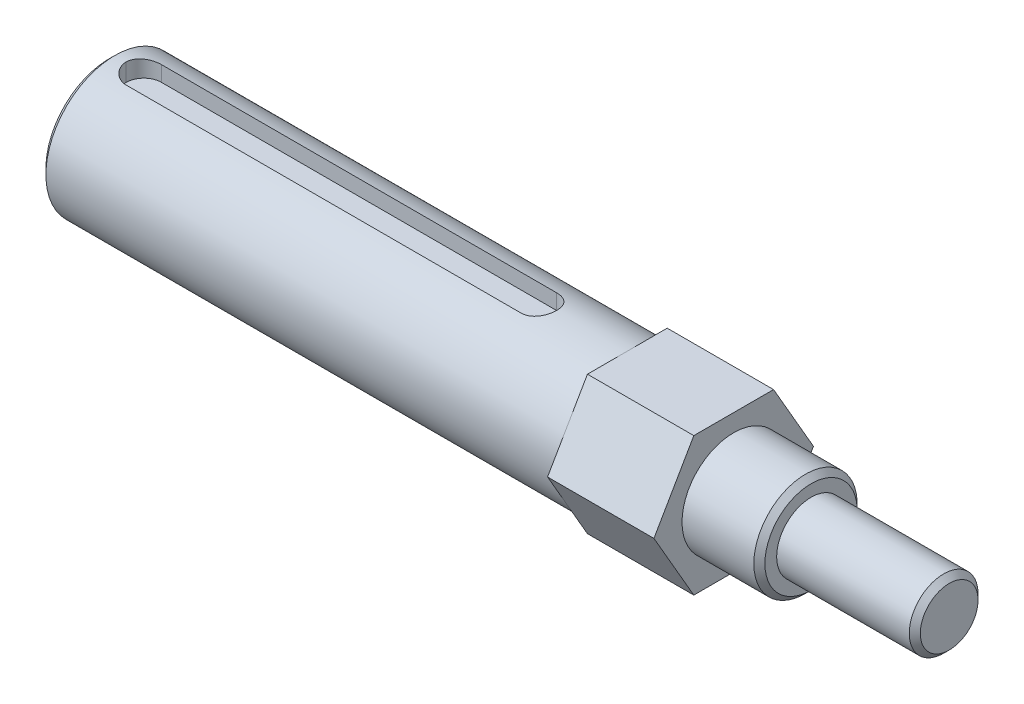
ISO-10303-21;
HEADER;
FILE_DESCRIPTION(('STEP AP214'),'2;1');
FILE_NAME('part.step','',(''),(''),'','','');
FILE_SCHEMA(('AUTOMOTIVE_DESIGN { 1 0 10303 214 1 1 1 1 }'));
ENDSEC;
DATA;
#1=APPLICATION_CONTEXT('core data for automotive mechanical design processes');
#2=APPLICATION_PROTOCOL_DEFINITION('international standard','automotive_design',2000,#1);
#3=PRODUCT_CONTEXT('',#1,'mechanical');
#4=PRODUCT('Part','Part','',(#3));
#5=PRODUCT_RELATED_PRODUCT_CATEGORY('part','',(#4));
#6=PRODUCT_DEFINITION_FORMATION('','',#4);
#7=PRODUCT_DEFINITION_CONTEXT('part definition',#1,'design');
#8=PRODUCT_DEFINITION('design','',#6,#7);
#9=PRODUCT_DEFINITION_SHAPE('','',#8);
#10=(LENGTH_UNIT() NAMED_UNIT(*) SI_UNIT(.MILLI.,.METRE.));
#11=(NAMED_UNIT(*) PLANE_ANGLE_UNIT() SI_UNIT($,.RADIAN.));
#12=(NAMED_UNIT(*) SI_UNIT($,.STERADIAN.) SOLID_ANGLE_UNIT());
#13=UNCERTAINTY_MEASURE_WITH_UNIT(LENGTH_MEASURE(1.E-05),#10,'distance_accuracy_value','');
#14=(GEOMETRIC_REPRESENTATION_CONTEXT(3) GLOBAL_UNCERTAINTY_ASSIGNED_CONTEXT((#13)) GLOBAL_UNIT_ASSIGNED_CONTEXT((#10,
#11,#12)) REPRESENTATION_CONTEXT('',''));
#15=CARTESIAN_POINT('',(0.,0.,0.));
#16=DIRECTION('',(0.,0.,1.));
#17=DIRECTION('',(1.,0.,0.));
#18=AXIS2_PLACEMENT_3D('',#15,#16,#17);
#19=CARTESIAN_POINT('',(-77.8966516553296,0.,0.));
#20=DIRECTION('',(-1.,0.,0.));
#21=DIRECTION('',(0.,0.,1.));
#22=AXIS2_PLACEMENT_3D('',#19,#20,#21);
#23=CYLINDRICAL_SURFACE('',#22,6.3373);
#24=CARTESIAN_POINT('',(-60.299507544,0.,0.));
#25=DIRECTION('',(1.,0.,0.));
#26=DIRECTION('',(0.,0.,-1.));
#27=AXIS2_PLACEMENT_3D('',#24,#25,#26);
#28=CIRCLE('',#27,6.3373);
#29=CARTESIAN_POINT('',(-60.299507544,0.,-6.3373));
#30=VERTEX_POINT('',#29);
#31=EDGE_CURVE('E12',#30,#30,#28,.T.);
#32=ORIENTED_EDGE('',*,*,#31,.T.);
#33=EDGE_LOOP('',(#32));
#34=FACE_BOUND('',#33,.T.);
#35=CARTESIAN_POINT('',(-13.1826,0.,0.));
#36=DIRECTION('',(1.,0.,0.));
#37=DIRECTION('',(0.,0.,-1.));
#38=AXIS2_PLACEMENT_3D('',#35,#36,#37);
#39=CIRCLE('',#38,6.3373);
#40=CARTESIAN_POINT('',(-13.1826,0.,-6.3373));
#41=VERTEX_POINT('',#40);
#42=EDGE_CURVE('E203',#41,#41,#39,.T.);
#43=ORIENTED_EDGE('',*,*,#42,.F.);
#44=EDGE_LOOP('',(#43));
#45=FACE_BOUND('',#44,.T.);
#46=DIRECTION('',(-1.,0.,0.));
#47=VECTOR('',#46,1.);
#48=CARTESIAN_POINT('',(-19.685,6.12525884595908,-1.6256));
#49=LINE('',#48,#47);
#50=CARTESIAN_POINT('',(-21.3106,6.12525884595908,-1.6256));
#51=VERTEX_POINT('',#50);
#52=CARTESIAN_POINT('',(-57.6326,6.12525884595908,-1.6256));
#53=VERTEX_POINT('',#52);
#54=EDGE_CURVE('E160',#51,#53,#49,.T.);
#55=ORIENTED_EDGE('',*,*,#54,.F.);
#56=CARTESIAN_POINT('',(-21.3106,6.12525884595908,-1.6256));
#57=CARTESIAN_POINT('',(-21.2656704057156,6.12525572384563,-1.62560059359541));
#58=CARTESIAN_POINT('',(-21.2207631160373,6.12575382111828,-1.62373611327884));
#59=CARTESIAN_POINT('',(-21.1312852297546,6.12772023070614,-1.61630382884971));
#60=CARTESIAN_POINT('',(-21.0867145755947,6.1291883731897,-1.61073667298571));
#61=CARTESIAN_POINT('',(-20.9541866425597,6.13498823313774,-1.58856472188929));
#62=CARTESIAN_POINT('',(-20.867141318364,6.1407157654718,-1.56648906409845));
#63=CARTESIAN_POINT('',(-20.6981498950922,6.15522368993519,-1.50846753261054));
#64=CARTESIAN_POINT('',(-20.6162032514929,6.16400375540148,-1.4725231430134));
#65=CARTESIAN_POINT('',(-20.4594573465982,6.18362256546917,-1.38782812844854));
#66=CARTESIAN_POINT('',(-20.3846603993658,6.19446197322662,-1.33907337630429));
#67=CARTESIAN_POINT('',(-20.2426607202283,6.2172556448923,-1.22895152920036));
#68=CARTESIAN_POINT('',(-20.1756473789229,6.22922835050251,-1.16734411036551));
#69=CARTESIAN_POINT('',(-20.0527746810287,6.25278150355666,-1.03377269014187));
#70=CARTESIAN_POINT('',(-19.996917445204,6.26436187607171,-0.961806724069569));
#71=CARTESIAN_POINT('',(-19.897152763142,6.28603333152416,-0.808240287847817));
#72=CARTESIAN_POINT('',(-19.8534373219082,6.2960994438836,-0.72651138810322));
#73=CARTESIAN_POINT('',(-19.7804621122823,6.3133870022584,-0.556585175203296));
#74=CARTESIAN_POINT('',(-19.7511910142288,6.3206106768832,-0.468392994195326));
#75=CARTESIAN_POINT('',(-19.7148282586417,6.32969793982603,-0.316446996824047));
#76=CARTESIAN_POINT('',(-19.703660534494,6.33253187833251,-0.253696589976846));
#77=CARTESIAN_POINT('',(-19.688741482479,6.33634021383192,-0.127308675421664));
#78=CARTESIAN_POINT('',(-19.6849851812931,6.33731585778887,-0.0636717914664028));
#79=CARTESIAN_POINT('',(-19.685,6.3373,0.));
#80=B_SPLINE_CURVE_WITH_KNOTS('',3,(#56,#57,#58,#59,#60,#61,#62,#63,#64,#65,#66,#67,#68,#69,#70,
#71,#72,#73,#74,#75,#76,#77,#78,#79),.UNSPECIFIED.,.F.,.F.,(4,2,2,2,2,2,2,2,2,2,2,4),(0.,
0.134703499533245,0.269383421961178,0.537937715227137,0.806463278330569,1.07507545991937,
1.34925144595122,1.62347950304872,1.90182481040237,2.17995144456139,2.37091142600285,
2.56174322311852),.UNSPECIFIED.);
#81=CARTESIAN_POINT('',(-19.685,6.3373,0.));
#82=VERTEX_POINT('',#81);
#83=EDGE_CURVE('E57',#51,#82,#80,.T.);
#84=ORIENTED_EDGE('',*,*,#83,.T.);
#85=CARTESIAN_POINT('',(-19.685,6.3373,0.));
#86=CARTESIAN_POINT('',(-19.6849994724776,6.33730262510674,0.0449542425937188));
#87=CARTESIAN_POINT('',(-19.6868659368972,6.3368210850164,0.0898862632128934));
#88=CARTESIAN_POINT('',(-19.6943065539844,6.33491762685194,0.179415017360768));
#89=CARTESIAN_POINT('',(-19.6998801100268,6.33349586009957,0.224011803674766));
#90=CARTESIAN_POINT('',(-19.722079783265,6.32787281500522,0.356627420790512));
#91=CARTESIAN_POINT('',(-19.744185266898,6.32231346764921,0.443736130091751));
#92=CARTESIAN_POINT('',(-19.8022935544823,6.30816926443299,0.612857979566186));
#93=CARTESIAN_POINT('',(-19.8382957426156,6.29958454264057,0.694871345347297));
#94=CARTESIAN_POINT('',(-19.923125953312,6.28030081893936,0.851727985893962));
#95=CARTESIAN_POINT('',(-19.9719575827631,6.2696012226615,0.926569236192276));
#96=CARTESIAN_POINT('',(-20.0821587854166,6.24699181616045,1.06852125543959));
#97=CARTESIAN_POINT('',(-20.1437513207542,6.23506269652202,1.13545577598838));
#98=CARTESIAN_POINT('',(-20.2772601848964,6.21146345120383,1.25817578073134));
#99=CARTESIAN_POINT('',(-20.3491788334945,6.19979338440312,1.31395875294065));
#100=CARTESIAN_POINT('',(-20.5026996009408,6.17783487513916,1.41364180067815));
#101=CARTESIAN_POINT('',(-20.5844383675886,6.1675715555603,1.45733724079769));
#102=CARTESIAN_POINT('',(-20.7543836681778,6.14988260208591,1.53027187336696));
#103=CARTESIAN_POINT('',(-20.8425848081236,6.14245463303677,1.55952296782704));
#104=CARTESIAN_POINT('',(-20.9944765842876,6.13310075202288,1.59583291165458));
#105=CARTESIAN_POINT('',(-21.0571592670381,6.13017934666502,1.6069770692438));
#106=CARTESIAN_POINT('',(-21.1834164651046,6.12624993016256,1.62186584965615));
#107=CARTESIAN_POINT('',(-21.2469904164994,6.12524075968339,1.62561495594876));
#108=CARTESIAN_POINT('',(-21.3106,6.12525884595908,1.6256));
#109=B_SPLINE_CURVE_WITH_KNOTS('',3,(#85,#86,#87,#88,#89,#90,#91,#92,#93,#94,#95,#96,#97,#98,
#99,#100,#101,#102,#103,#104,#105,#106,#107,#108),.UNSPECIFIED.,.F.,.F.,(4,2,2,2,2,2,2,2,2,2,2,
4),(0.,0.134777673646629,0.269533661211901,0.538262128855104,0.806978689442318,1.07577087838815,
1.34972979958482,1.62375036308561,1.90215983877244,2.18033952316408,2.37109902366022,
2.56174283495162),.UNSPECIFIED.);
#110=CARTESIAN_POINT('',(-21.3106,6.12525884595908,1.6256));
#111=VERTEX_POINT('',#110);
#112=EDGE_CURVE('E224',#82,#111,#109,.T.);
#113=ORIENTED_EDGE('',*,*,#112,.T.);
#114=DIRECTION('',(-1.,0.,0.));
#115=VECTOR('',#114,1.);
#116=CARTESIAN_POINT('',(-19.685,6.12525884595908,1.6256));
#117=LINE('',#116,#115);
#118=CARTESIAN_POINT('',(-57.6326,6.12525884595908,1.6256));
#119=VERTEX_POINT('',#118);
#120=EDGE_CURVE('E173',#111,#119,#117,.T.);
#121=ORIENTED_EDGE('',*,*,#120,.T.);
#122=CARTESIAN_POINT('',(-57.6326,6.12525884595908,1.6256));
#123=CARTESIAN_POINT('',(-57.6775295942844,6.12525572384562,1.62560059359541));
#124=CARTESIAN_POINT('',(-57.7224368839627,6.12575382111828,1.62373611327884));
#125=CARTESIAN_POINT('',(-57.8119147702454,6.12772023070614,1.61630382884971));
#126=CARTESIAN_POINT('',(-57.8564854244053,6.1291883731897,1.61073667298571));
#127=CARTESIAN_POINT('',(-57.9890133574403,6.13498823313774,1.58856472188929));
#128=CARTESIAN_POINT('',(-58.076058681636,6.1407157654718,1.56648906409845));
#129=CARTESIAN_POINT('',(-58.2450501049078,6.15522368993518,1.50846753261054));
#130=CARTESIAN_POINT('',(-58.3269967485071,6.16400375540147,1.4725231430134));
#131=CARTESIAN_POINT('',(-58.4837426534018,6.18362256546917,1.38782812844854));
#132=CARTESIAN_POINT('',(-58.5585396006342,6.19446197322662,1.33907337630429));
#133=CARTESIAN_POINT('',(-58.7005392797717,6.2172556448923,1.22895152920036));
#134=CARTESIAN_POINT('',(-58.7675526210771,6.22922835050251,1.16734411036551));
#135=CARTESIAN_POINT('',(-58.8904253189713,6.25278150355666,1.03377269014188));
#136=CARTESIAN_POINT('',(-58.946282554796,6.2643618760717,0.961806724069576));
#137=CARTESIAN_POINT('',(-59.046047236858,6.28603333152416,0.808240287847822));
#138=CARTESIAN_POINT('',(-59.0897626780918,6.2960994438836,0.726511388103223));
#139=CARTESIAN_POINT('',(-59.1627378877177,6.3133870022584,0.5565851752033));
#140=CARTESIAN_POINT('',(-59.1920089857712,6.3206106768832,0.468392994195332));
#141=CARTESIAN_POINT('',(-59.2283717413583,6.32969793982603,0.316446996824053));
#142=CARTESIAN_POINT('',(-59.239539465506,6.33253187833251,0.25369658997685));
#143=CARTESIAN_POINT('',(-59.254458517521,6.33634021383191,0.127308675421667));
#144=CARTESIAN_POINT('',(-59.2582148187069,6.33731585778887,0.063671791466404));
#145=CARTESIAN_POINT('',(-59.2582,6.3373,0.));
#146=B_SPLINE_CURVE_WITH_KNOTS('',3,(#122,#123,#124,#125,#126,#127,#128,#129,#130,#131,#132,
#133,#134,#135,#136,#137,#138,#139,#140,#141,#142,#143,#144,#145),.UNSPECIFIED.,.F.,.F.,(4,2,2,
2,2,2,2,2,2,2,2,4),(0.,0.134703499533245,0.269383421961175,0.537937715227133,0.806463278330568,
1.07507545991937,1.34925144595121,1.62347950304871,1.90182481040237,2.17995144456138,
2.37091142600284,2.56174322311852),.UNSPECIFIED.);
#147=CARTESIAN_POINT('',(-59.2582,6.3373,0.));
#148=VERTEX_POINT('',#147);
#149=EDGE_CURVE('E50',#119,#148,#146,.T.);
#150=ORIENTED_EDGE('',*,*,#149,.T.);
#151=CARTESIAN_POINT('',(-59.2582,6.3373,0.));
#152=CARTESIAN_POINT('',(-59.2582005275224,6.33730262510674,-0.0449542425937189));
#153=CARTESIAN_POINT('',(-59.2563340631028,6.3368210850164,-0.0898862632128936));
#154=CARTESIAN_POINT('',(-59.2488934460156,6.33491762685194,-0.179415017360768));
#155=CARTESIAN_POINT('',(-59.2433198899732,6.33349586009958,-0.224011803674766));
#156=CARTESIAN_POINT('',(-59.221120216735,6.32787281500522,-0.356627420790512));
#157=CARTESIAN_POINT('',(-59.199014733102,6.32231346764921,-0.443736130091751));
#158=CARTESIAN_POINT('',(-59.1409064455177,6.30816926443299,-0.612857979566185));
#159=CARTESIAN_POINT('',(-59.1049042573844,6.29958454264057,-0.694871345347295));
#160=CARTESIAN_POINT('',(-59.020074046688,6.28030081893936,-0.85172798589396));
#161=CARTESIAN_POINT('',(-58.9712424172369,6.2696012226615,-0.926569236192274));
#162=CARTESIAN_POINT('',(-58.8610412145834,6.24699181616045,-1.06852125543958));
#163=CARTESIAN_POINT('',(-58.7994486792458,6.23506269652202,-1.13545577598838));
#164=CARTESIAN_POINT('',(-58.6659398151036,6.21146345120383,-1.25817578073134));
#165=CARTESIAN_POINT('',(-58.5940211665055,6.19979338440312,-1.31395875294064));
#166=CARTESIAN_POINT('',(-58.4405003990592,6.17783487513916,-1.41364180067815));
#167=CARTESIAN_POINT('',(-58.3587616324114,6.1675715555603,-1.45733724079769));
#168=CARTESIAN_POINT('',(-58.1888163318222,6.14988260208591,-1.53027187336696));
#169=CARTESIAN_POINT('',(-58.1006151918764,6.14245463303677,-1.55952296782704));
#170=CARTESIAN_POINT('',(-57.9487234157124,6.13310075202288,-1.59583291165458));
#171=CARTESIAN_POINT('',(-57.8860407329619,6.13017934666502,-1.6069770692438));
#172=CARTESIAN_POINT('',(-57.7597835348954,6.12624993016256,-1.62186584965615));
#173=CARTESIAN_POINT('',(-57.6962095835006,6.12524075968339,-1.62561495594876));
#174=CARTESIAN_POINT('',(-57.6326,6.12525884595908,-1.6256));
#175=B_SPLINE_CURVE_WITH_KNOTS('',3,(#151,#152,#153,#154,#155,#156,#157,#158,#159,#160,#161,
#162,#163,#164,#165,#166,#167,#168,#169,#170,#171,#172,#173,#174),.UNSPECIFIED.,.F.,.F.,(4,2,2,
2,2,2,2,2,2,2,2,4),(0.,0.134777673646629,0.2695336612119,0.538262128855103,0.806978689442315,
1.07577087838815,1.34972979958481,1.6237503630856,1.90215983877244,2.18033952316408,
2.37109902366021,2.56174283495161),.UNSPECIFIED.);
#176=EDGE_CURVE('E261',#148,#53,#175,.T.);
#177=ORIENTED_EDGE('',*,*,#176,.T.);
#178=EDGE_LOOP('',(#55,#84,#113,#121,#150,#177));
#179=FACE_BOUND('',#178,.T.);
#180=ADVANCED_FACE('F35',(#34,#45,#179),#23,.T.);
#181=CARTESIAN_POINT('',(16.4084,3.16215,0.));
#182=DIRECTION('',(-1.,0.,0.));
#183=DIRECTION('',(0.,0.,1.));
#184=AXIS2_PLACEMENT_3D('',#181,#182,#183);
#185=PLANE('',#184);
#186=CARTESIAN_POINT('',(16.4084,0.,0.));
#187=DIRECTION('',(-1.,0.,0.));
#188=DIRECTION('',(0.,0.,1.));
#189=AXIS2_PLACEMENT_3D('',#186,#187,#188);
#190=CIRCLE('',#189,2.65405754399999);
#191=CARTESIAN_POINT('',(16.4084,0.,2.65405754399999));
#192=VERTEX_POINT('',#191);
#193=EDGE_CURVE('E275',#192,#192,#190,.F.);
#194=ORIENTED_EDGE('',*,*,#193,.T.);
#195=EDGE_LOOP('',(#194));
#196=FACE_BOUND('',#195,.T.);
#197=ADVANCED_FACE('F298',(#196),#185,.F.);
#198=CARTESIAN_POINT('',(-77.8966516553296,0.,0.));
#199=DIRECTION('',(-1.,0.,0.));
#200=DIRECTION('',(0.,0.,1.));
#201=AXIS2_PLACEMENT_3D('',#198,#199,#200);
#202=CYLINDRICAL_SURFACE('',#201,3.16215);
#203=CARTESIAN_POINT('',(15.900307544,0.,0.));
#204=DIRECTION('',(-1.,0.,0.));
#205=DIRECTION('',(0.,0.,1.));
#206=AXIS2_PLACEMENT_3D('',#203,#204,#205);
#207=CIRCLE('',#206,3.16215);
#208=CARTESIAN_POINT('',(15.900307544,0.,3.16215));
#209=VERTEX_POINT('',#208);
#210=EDGE_CURVE('E266',#209,#209,#207,.T.);
#211=ORIENTED_EDGE('',*,*,#210,.T.);
#212=EDGE_LOOP('',(#211));
#213=FACE_BOUND('',#212,.T.);
#214=CARTESIAN_POINT('',(3.7084,0.,0.));
#215=DIRECTION('',(-1.,0.,0.));
#216=DIRECTION('',(0.,0.,1.));
#217=AXIS2_PLACEMENT_3D('',#214,#215,#216);
#218=CIRCLE('',#217,3.16215);
#219=CARTESIAN_POINT('',(3.7084,0.,3.16215));
#220=VERTEX_POINT('',#219);
#221=EDGE_CURVE('E194',#220,#220,#218,.T.);
#222=ORIENTED_EDGE('',*,*,#221,.F.);
#223=EDGE_LOOP('',(#222));
#224=FACE_BOUND('',#223,.T.);
#225=ADVANCED_FACE('F303',(#213,#224),#202,.T.);
#226=CARTESIAN_POINT('',(3.70839999999999,4.7498,0.));
#227=DIRECTION('',(-1.,0.,0.));
#228=DIRECTION('',(0.,0.,1.));
#229=AXIS2_PLACEMENT_3D('',#226,#227,#228);
#230=PLANE('',#229);
#231=CARTESIAN_POINT('',(3.70839999999999,0.,0.));
#232=DIRECTION('',(-1.,0.,0.));
#233=DIRECTION('',(0.,0.,1.));
#234=AXIS2_PLACEMENT_3D('',#231,#232,#233);
#235=CIRCLE('',#234,4.24170754400003);
#236=CARTESIAN_POINT('',(3.70839999999999,0.,4.24170754400003));
#237=VERTEX_POINT('',#236);
#238=EDGE_CURVE('E281',#237,#237,#235,.F.);
#239=ORIENTED_EDGE('',*,*,#238,.T.);
#240=EDGE_LOOP('',(#239));
#241=FACE_BOUND('',#240,.T.);
#242=ORIENTED_EDGE('',*,*,#221,.T.);
#243=EDGE_LOOP('',(#242));
#244=FACE_BOUND('',#243,.T.);
#245=ADVANCED_FACE('F371',(#241,#244),#230,.F.);
#246=CARTESIAN_POINT('',(-77.8966516553296,0.,0.));
#247=DIRECTION('',(-1.,0.,0.));
#248=DIRECTION('',(0.,0.,1.));
#249=AXIS2_PLACEMENT_3D('',#246,#247,#248);
#250=CYLINDRICAL_SURFACE('',#249,4.7498);
#251=CARTESIAN_POINT('',(3.20030754400003,0.,0.));
#252=DIRECTION('',(-1.,0.,0.));
#253=DIRECTION('',(0.,0.,1.));
#254=AXIS2_PLACEMENT_3D('',#251,#252,#253);
#255=CIRCLE('',#254,4.7498);
#256=CARTESIAN_POINT('',(3.20030754400003,0.,4.7498));
#257=VERTEX_POINT('',#256);
#258=EDGE_CURVE('E278',#257,#257,#255,.T.);
#259=ORIENTED_EDGE('',*,*,#258,.T.);
#260=EDGE_LOOP('',(#259));
#261=FACE_BOUND('',#260,.T.);
#262=CARTESIAN_POINT('',(-3.40360000000001,0.,0.));
#263=DIRECTION('',(-1.,0.,0.));
#264=DIRECTION('',(0.,0.,1.));
#265=AXIS2_PLACEMENT_3D('',#262,#263,#264);
#266=CIRCLE('',#265,4.7498);
#267=CARTESIAN_POINT('',(-3.40360000000001,0.,4.7498));
#268=VERTEX_POINT('',#267);
#269=EDGE_CURVE('E184',#268,#268,#266,.T.);
#270=ORIENTED_EDGE('',*,*,#269,.F.);
#271=EDGE_LOOP('',(#270));
#272=FACE_BOUND('',#271,.T.);
#273=ADVANCED_FACE('F367',(#261,#272),#250,.T.);
#274=CARTESIAN_POINT('',(-3.40360000000001,4.7498,0.));
#275=DIRECTION('',(-1.,0.,0.));
#276=DIRECTION('',(0.,0.,1.));
#277=AXIS2_PLACEMENT_3D('',#274,#275,#276);
#278=PLANE('',#277);
#279=ORIENTED_EDGE('',*,*,#269,.T.);
#280=EDGE_LOOP('',(#279));
#281=FACE_BOUND('',#280,.T.);
#282=DIRECTION('',(0.,-0.866025403784439,0.5));
#283=VECTOR('',#282,1.);
#284=CARTESIAN_POINT('',(-3.40360000000001,6.35000000000006,3.66617420935416));
#285=LINE('',#284,#283);
#286=CARTESIAN_POINT('',(-3.40360000000001,6.35000000000006,3.66617420935416));
#287=VERTEX_POINT('',#286);
#288=CARTESIAN_POINT('',(-3.40360000000001,0.,7.33234841870831));
#289=VERTEX_POINT('',#288);
#290=EDGE_CURVE('E171',#287,#289,#285,.T.);
#291=ORIENTED_EDGE('',*,*,#290,.T.);
#292=DIRECTION('',(0.,-0.866025403784438,-0.5));
#293=VECTOR('',#292,1.);
#294=CARTESIAN_POINT('',(-3.40360000000001,0.,7.33234841870831));
#295=LINE('',#294,#293);
#296=CARTESIAN_POINT('',(-3.40360000000001,-6.35000000000005,3.66617420935415));
#297=VERTEX_POINT('',#296);
#298=EDGE_CURVE('E132',#289,#297,#295,.T.);
#299=ORIENTED_EDGE('',*,*,#298,.T.);
#300=DIRECTION('',(0.,0.,-1.));
#301=VECTOR('',#300,1.);
#302=CARTESIAN_POINT('',(-3.40360000000001,-6.35000000000005,3.66617420935415));
#303=LINE('',#302,#301);
#304=CARTESIAN_POINT('',(-3.40360000000001,-6.35000000000005,-3.66617420935416));
#305=VERTEX_POINT('',#304);
#306=EDGE_CURVE('E175',#297,#305,#303,.T.);
#307=ORIENTED_EDGE('',*,*,#306,.T.);
#308=DIRECTION('',(0.,0.866025403784439,-0.5));
#309=VECTOR('',#308,1.);
#310=CARTESIAN_POINT('',(-3.40360000000001,-6.35000000000005,-3.66617420935416));
#311=LINE('',#310,#309);
#312=CARTESIAN_POINT('',(-3.40360000000001,0.,-7.33234841870831));
#313=VERTEX_POINT('',#312);
#314=EDGE_CURVE('E178',#305,#313,#311,.T.);
#315=ORIENTED_EDGE('',*,*,#314,.T.);
#316=DIRECTION('',(0.,0.866025403784439,0.5));
#317=VECTOR('',#316,1.);
#318=CARTESIAN_POINT('',(-3.40360000000001,0.,-7.33234841870831));
#319=LINE('',#318,#317);
#320=CARTESIAN_POINT('',(-3.40360000000001,6.35000000000006,-3.66617420935416));
#321=VERTEX_POINT('',#320);
#322=EDGE_CURVE('E157',#313,#321,#319,.T.);
#323=ORIENTED_EDGE('',*,*,#322,.T.);
#324=DIRECTION('',(0.,0.,1.));
#325=VECTOR('',#324,1.);
#326=CARTESIAN_POINT('',(-3.40360000000001,6.35000000000006,-3.66617420935416));
#327=LINE('',#326,#325);
#328=EDGE_CURVE('E154',#321,#287,#327,.T.);
#329=ORIENTED_EDGE('',*,*,#328,.T.);
#330=EDGE_LOOP('',(#291,#299,#307,#315,#323,#329));
#331=FACE_BOUND('',#330,.T.);
#332=ADVANCED_FACE('F343',(#281,#331),#278,.F.);
#333=CARTESIAN_POINT('',(-13.1826,0.,7.33234841870831));
#334=DIRECTION('',(1.,0.,0.));
#335=DIRECTION('',(0.,0.,-1.));
#336=AXIS2_PLACEMENT_3D('',#333,#334,#335);
#337=PLANE('',#336);
#338=DIRECTION('',(0.,-0.866025403784439,0.5));
#339=VECTOR('',#338,1.);
#340=CARTESIAN_POINT('',(-13.1826,6.35000000000006,3.66617420935416));
#341=LINE('',#340,#339);
#342=CARTESIAN_POINT('',(-13.1826,6.35000000000006,3.66617420935416));
#343=VERTEX_POINT('',#342);
#344=CARTESIAN_POINT('',(-13.1826,0.,7.33234841870831));
#345=VERTEX_POINT('',#344);
#346=EDGE_CURVE('E146',#343,#345,#341,.T.);
#347=ORIENTED_EDGE('',*,*,#346,.F.);
#348=DIRECTION('',(0.,0.,1.));
#349=VECTOR('',#348,1.);
#350=CARTESIAN_POINT('',(-13.1826,6.35000000000006,-3.66617420935416));
#351=LINE('',#350,#349);
#352=CARTESIAN_POINT('',(-13.1826,6.35000000000006,-3.66617420935416));
#353=VERTEX_POINT('',#352);
#354=EDGE_CURVE('E138',#353,#343,#351,.T.);
#355=ORIENTED_EDGE('',*,*,#354,.F.);
#356=DIRECTION('',(0.,0.866025403784439,0.5));
#357=VECTOR('',#356,1.);
#358=CARTESIAN_POINT('',(-13.1826,0.,-7.33234841870831));
#359=LINE('',#358,#357);
#360=CARTESIAN_POINT('',(-13.1826,0.,-7.33234841870831));
#361=VERTEX_POINT('',#360);
#362=EDGE_CURVE('E167',#361,#353,#359,.T.);
#363=ORIENTED_EDGE('',*,*,#362,.F.);
#364=DIRECTION('',(0.,0.866025403784439,-0.5));
#365=VECTOR('',#364,1.);
#366=CARTESIAN_POINT('',(-13.1826,-6.35000000000005,-3.66617420935416));
#367=LINE('',#366,#365);
#368=CARTESIAN_POINT('',(-13.1826,-6.35000000000005,-3.66617420935416));
#369=VERTEX_POINT('',#368);
#370=EDGE_CURVE('E164',#369,#361,#367,.T.);
#371=ORIENTED_EDGE('',*,*,#370,.F.);
#372=DIRECTION('',(0.,0.,-1.));
#373=VECTOR('',#372,1.);
#374=CARTESIAN_POINT('',(-13.1826,-6.35000000000005,3.66617420935415));
#375=LINE('',#374,#373);
#376=CARTESIAN_POINT('',(-13.1826,-6.35000000000005,3.66617420935415));
#377=VERTEX_POINT('',#376);
#378=EDGE_CURVE('E150',#377,#369,#375,.T.);
#379=ORIENTED_EDGE('',*,*,#378,.F.);
#380=DIRECTION('',(0.,-0.866025403784438,-0.5));
#381=VECTOR('',#380,1.);
#382=CARTESIAN_POINT('',(-13.1826,0.,7.33234841870831));
#383=LINE('',#382,#381);
#384=EDGE_CURVE('E130',#345,#377,#383,.T.);
#385=ORIENTED_EDGE('',*,*,#384,.F.);
#386=EDGE_LOOP('',(#347,#355,#363,#371,#379,#385));
#387=FACE_BOUND('',#386,.T.);
#388=ORIENTED_EDGE('',*,*,#42,.T.);
#389=EDGE_LOOP('',(#388));
#390=FACE_BOUND('',#389,.T.);
#391=ADVANCED_FACE('F143',(#387,#390),#337,.F.);
#392=CARTESIAN_POINT('',(-13.1826,6.35000000000006,3.66617420935416));
#393=DIRECTION('',(0.,0.5,0.866025403784439));
#394=DIRECTION('',(0.,-0.866025403784439,0.5));
#395=AXIS2_PLACEMENT_3D('',#392,#393,#394);
#396=PLANE('',#395);
#397=ORIENTED_EDGE('',*,*,#290,.F.);
#398=DIRECTION('',(1.,0.,0.));
#399=VECTOR('',#398,1.);
#400=CARTESIAN_POINT('',(-13.1826,6.35000000000006,3.66617420935416));
#401=LINE('',#400,#399);
#402=EDGE_CURVE('E153',#343,#287,#401,.T.);
#403=ORIENTED_EDGE('',*,*,#402,.F.);
#404=ORIENTED_EDGE('',*,*,#346,.T.);
#405=DIRECTION('',(1.,0.,0.));
#406=VECTOR('',#405,1.);
#407=CARTESIAN_POINT('',(-13.1826,0.,7.33234841870831));
#408=LINE('',#407,#406);
#409=EDGE_CURVE('E127',#345,#289,#408,.T.);
#410=ORIENTED_EDGE('',*,*,#409,.T.);
#411=EDGE_LOOP('',(#397,#403,#404,#410));
#412=FACE_BOUND('',#411,.T.);
#413=ADVANCED_FACE('F152',(#412),#396,.T.);
#414=CARTESIAN_POINT('',(-13.1826,6.35000000000006,-3.66617420935416));
#415=DIRECTION('',(0.,1.,0.));
#416=DIRECTION('',(0.,0.,1.));
#417=AXIS2_PLACEMENT_3D('',#414,#415,#416);
#418=PLANE('',#417);
#419=ORIENTED_EDGE('',*,*,#328,.F.);
#420=DIRECTION('',(1.,0.,0.));
#421=VECTOR('',#420,1.);
#422=CARTESIAN_POINT('',(-13.1826,6.35000000000006,-3.66617420935416));
#423=LINE('',#422,#421);
#424=EDGE_CURVE('E185',#353,#321,#423,.T.);
#425=ORIENTED_EDGE('',*,*,#424,.F.);
#426=ORIENTED_EDGE('',*,*,#354,.T.);
#427=ORIENTED_EDGE('',*,*,#402,.T.);
#428=EDGE_LOOP('',(#419,#425,#426,#427));
#429=FACE_BOUND('',#428,.T.);
#430=ADVANCED_FACE('F344',(#429),#418,.T.);
#431=CARTESIAN_POINT('',(-13.1826,0.,-7.33234841870831));
#432=DIRECTION('',(0.,0.5,-0.866025403784438));
#433=DIRECTION('',(0.,0.866025403784439,0.5));
#434=AXIS2_PLACEMENT_3D('',#431,#432,#433);
#435=PLANE('',#434);
#436=ORIENTED_EDGE('',*,*,#322,.F.);
#437=DIRECTION('',(1.,0.,0.));
#438=VECTOR('',#437,1.);
#439=CARTESIAN_POINT('',(-13.1826,0.,-7.33234841870831));
#440=LINE('',#439,#438);
#441=EDGE_CURVE('E187',#361,#313,#440,.T.);
#442=ORIENTED_EDGE('',*,*,#441,.F.);
#443=ORIENTED_EDGE('',*,*,#362,.T.);
#444=ORIENTED_EDGE('',*,*,#424,.T.);
#445=EDGE_LOOP('',(#436,#442,#443,#444));
#446=FACE_BOUND('',#445,.T.);
#447=ADVANCED_FACE('F347',(#446),#435,.T.);
#448=CARTESIAN_POINT('',(-13.1826,-6.35000000000005,-3.66617420935416));
#449=DIRECTION('',(0.,-0.5,-0.866025403784439));
#450=DIRECTION('',(0.,0.866025403784439,-0.5));
#451=AXIS2_PLACEMENT_3D('',#448,#449,#450);
#452=PLANE('',#451);
#453=ORIENTED_EDGE('',*,*,#314,.F.);
#454=DIRECTION('',(1.,0.,0.));
#455=VECTOR('',#454,1.);
#456=CARTESIAN_POINT('',(-13.1826,-6.35000000000005,-3.66617420935416));
#457=LINE('',#456,#455);
#458=EDGE_CURVE('E189',#369,#305,#457,.T.);
#459=ORIENTED_EDGE('',*,*,#458,.F.);
#460=ORIENTED_EDGE('',*,*,#370,.T.);
#461=ORIENTED_EDGE('',*,*,#441,.T.);
#462=EDGE_LOOP('',(#453,#459,#460,#461));
#463=FACE_BOUND('',#462,.T.);
#464=ADVANCED_FACE('F351',(#463),#452,.T.);
#465=CARTESIAN_POINT('',(-13.1826,-6.35000000000005,3.66617420935415));
#466=DIRECTION('',(0.,-1.,0.));
#467=DIRECTION('',(0.,0.,-1.));
#468=AXIS2_PLACEMENT_3D('',#465,#466,#467);
#469=PLANE('',#468);
#470=ORIENTED_EDGE('',*,*,#306,.F.);
#471=DIRECTION('',(1.,0.,0.));
#472=VECTOR('',#471,1.);
#473=CARTESIAN_POINT('',(-13.1826,-6.35000000000005,3.66617420935415));
#474=LINE('',#473,#472);
#475=EDGE_CURVE('E137',#377,#297,#474,.T.);
#476=ORIENTED_EDGE('',*,*,#475,.F.);
#477=ORIENTED_EDGE('',*,*,#378,.T.);
#478=ORIENTED_EDGE('',*,*,#458,.T.);
#479=EDGE_LOOP('',(#470,#476,#477,#478));
#480=FACE_BOUND('',#479,.T.);
#481=ADVANCED_FACE('F355',(#480),#469,.T.);
#482=CARTESIAN_POINT('',(-13.1826,0.,7.33234841870831));
#483=DIRECTION('',(0.,-0.5,0.866025403784438));
#484=DIRECTION('',(0.,-0.866025403784438,-0.5));
#485=AXIS2_PLACEMENT_3D('',#482,#483,#484);
#486=PLANE('',#485);
#487=ORIENTED_EDGE('',*,*,#298,.F.);
#488=ORIENTED_EDGE('',*,*,#409,.F.);
#489=ORIENTED_EDGE('',*,*,#384,.T.);
#490=ORIENTED_EDGE('',*,*,#475,.T.);
#491=EDGE_LOOP('',(#487,#488,#489,#490));
#492=FACE_BOUND('',#491,.T.);
#493=ADVANCED_FACE('F129',(#492),#486,.T.);
#494=CARTESIAN_POINT('',(-44.9326,0.,0.));
#495=DIRECTION('',(-1.,0.,0.));
#496=DIRECTION('',(0.,0.,1.));
#497=AXIS2_PLACEMENT_3D('',#494,#495,#496);
#498=CONICAL_SURFACE('',#497,2.48793,1.02974425866567);
#499=CARTESIAN_POINT('',(-43.4377008400656,0.,0.));
#500=VERTEX_POINT('',#499);
#501=VERTEX_LOOP('',#500);
#502=FACE_BOUND('',#501,.T.);
#503=CARTESIAN_POINT('',(-44.9326,0.,0.));
#504=DIRECTION('',(-1.,0.,0.));
#505=DIRECTION('',(0.,0.,1.));
#506=AXIS2_PLACEMENT_3D('',#503,#504,#505);
#507=CIRCLE('',#506,2.48793);
#508=CARTESIAN_POINT('',(-44.9326,0.,2.48793));
#509=VERTEX_POINT('',#508);
#510=EDGE_CURVE('E197',#509,#509,#507,.T.);
#511=ORIENTED_EDGE('',*,*,#510,.T.);
#512=EDGE_LOOP('',(#511));
#513=FACE_BOUND('',#512,.T.);
#514=ADVANCED_FACE('F362',(#502,#513),#498,.F.);
#515=CARTESIAN_POINT('',(-77.8966516553296,0.,0.));
#516=DIRECTION('',(-1.,0.,0.));
#517=DIRECTION('',(0.,0.,1.));
#518=AXIS2_PLACEMENT_3D('',#515,#516,#517);
#519=CYLINDRICAL_SURFACE('',#518,2.48793);
#520=ORIENTED_EDGE('',*,*,#510,.F.);
#521=EDGE_LOOP('',(#520));
#522=FACE_BOUND('',#521,.T.);
#523=CARTESIAN_POINT('',(-60.8076,0.,0.));
#524=DIRECTION('',(-1.,0.,0.));
#525=DIRECTION('',(0.,0.,1.));
#526=AXIS2_PLACEMENT_3D('',#523,#524,#525);
#527=CIRCLE('',#526,2.48793);
#528=CARTESIAN_POINT('',(-60.8076,0.,2.48793));
#529=VERTEX_POINT('',#528);
#530=EDGE_CURVE('E200',#529,#529,#527,.T.);
#531=ORIENTED_EDGE('',*,*,#530,.T.);
#532=EDGE_LOOP('',(#531));
#533=FACE_BOUND('',#532,.T.);
#534=ADVANCED_FACE('F381',(#522,#533),#519,.F.);
#535=CARTESIAN_POINT('',(-60.8076,2.48793,0.));
#536=DIRECTION('',(1.,0.,0.));
#537=DIRECTION('',(0.,0.,-1.));
#538=AXIS2_PLACEMENT_3D('',#535,#536,#537);
#539=PLANE('',#538);
#540=CARTESIAN_POINT('',(-60.8076,0.,0.));
#541=DIRECTION('',(1.,0.,0.));
#542=DIRECTION('',(0.,0.,-1.));
#543=AXIS2_PLACEMENT_3D('',#540,#541,#542);
#544=CIRCLE('',#543,5.82920754399999);
#545=CARTESIAN_POINT('',(-60.8076,0.,-5.82920754399999));
#546=VERTEX_POINT('',#545);
#547=EDGE_CURVE('E43',#546,#546,#544,.F.);
#548=ORIENTED_EDGE('',*,*,#547,.T.);
#549=EDGE_LOOP('',(#548));
#550=FACE_BOUND('',#549,.T.);
#551=ORIENTED_EDGE('',*,*,#530,.F.);
#552=EDGE_LOOP('',(#551));
#553=FACE_BOUND('',#552,.T.);
#554=ADVANCED_FACE('F286',(#550,#553),#539,.F.);
#555=CARTESIAN_POINT('',(-19.685,4.7117,1.6256));
#556=DIRECTION('',(0.,0.,1.));
#557=DIRECTION('',(0.,-1.,0.));
#558=AXIS2_PLACEMENT_3D('',#555,#556,#557);
#559=PLANE('',#558);
#560=ORIENTED_EDGE('',*,*,#120,.F.);
#561=DIRECTION('',(0.,1.,0.));
#562=VECTOR('',#561,1.);
#563=CARTESIAN_POINT('',(-21.3106,4.7117,1.6256));
#564=LINE('',#563,#562);
#565=CARTESIAN_POINT('',(-21.3106,4.7117,1.6256));
#566=VERTEX_POINT('',#565);
#567=EDGE_CURVE('E209',#111,#566,#564,.F.);
#568=ORIENTED_EDGE('',*,*,#567,.T.);
#569=DIRECTION('',(-1.,0.,0.));
#570=VECTOR('',#569,1.);
#571=CARTESIAN_POINT('',(-19.685,4.7117,1.6256));
#572=LINE('',#571,#570);
#573=CARTESIAN_POINT('',(-57.6326,4.7117,1.6256));
#574=VERTEX_POINT('',#573);
#575=EDGE_CURVE('E322',#566,#574,#572,.T.);
#576=ORIENTED_EDGE('',*,*,#575,.T.);
#577=DIRECTION('',(0.,1.,0.));
#578=VECTOR('',#577,1.);
#579=CARTESIAN_POINT('',(-57.6326,6.12525884595908,1.6256));
#580=LINE('',#579,#578);
#581=EDGE_CURVE('E206',#574,#119,#580,.T.);
#582=ORIENTED_EDGE('',*,*,#581,.T.);
#583=EDGE_LOOP('',(#560,#568,#576,#582));
#584=FACE_BOUND('',#583,.T.);
#585=ADVANCED_FACE('F318',(#584),#559,.F.);
#586=CARTESIAN_POINT('',(-19.685,4.7117,-1.6256));
#587=DIRECTION('',(0.,-1.,0.));
#588=DIRECTION('',(0.,0.,-1.));
#589=AXIS2_PLACEMENT_3D('',#586,#587,#588);
#590=PLANE('',#589);
#591=ORIENTED_EDGE('',*,*,#575,.F.);
#592=CARTESIAN_POINT('',(-21.3106,4.7117,0.));
#593=DIRECTION('',(0.,-1.,0.));
#594=DIRECTION('',(0.,0.,-1.));
#595=AXIS2_PLACEMENT_3D('',#592,#593,#594);
#596=CIRCLE('',#595,1.6256);
#597=CARTESIAN_POINT('',(-19.685,4.7117,0.));
#598=VERTEX_POINT('',#597);
#599=EDGE_CURVE('E218',#566,#598,#596,.F.);
#600=ORIENTED_EDGE('',*,*,#599,.T.);
#601=CARTESIAN_POINT('',(-21.3106,4.7117,0.));
#602=DIRECTION('',(0.,-1.,0.));
#603=DIRECTION('',(0.,0.,-1.));
#604=AXIS2_PLACEMENT_3D('',#601,#602,#603);
#605=CIRCLE('',#604,1.6256);
#606=CARTESIAN_POINT('',(-21.3106,4.7117,-1.6256));
#607=VERTEX_POINT('',#606);
#608=EDGE_CURVE('E216',#598,#607,#605,.F.);
#609=ORIENTED_EDGE('',*,*,#608,.T.);
#610=DIRECTION('',(-1.,0.,0.));
#611=VECTOR('',#610,1.);
#612=CARTESIAN_POINT('',(-19.685,4.7117,-1.6256));
#613=LINE('',#612,#611);
#614=CARTESIAN_POINT('',(-57.6326,4.7117,-1.6256));
#615=VERTEX_POINT('',#614);
#616=EDGE_CURVE('E311',#607,#615,#613,.T.);
#617=ORIENTED_EDGE('',*,*,#616,.T.);
#618=CARTESIAN_POINT('',(-57.6326,4.7117,0.));
#619=DIRECTION('',(0.,-1.,0.));
#620=DIRECTION('',(0.,0.,-1.));
#621=AXIS2_PLACEMENT_3D('',#618,#619,#620);
#622=CIRCLE('',#621,1.6256);
#623=CARTESIAN_POINT('',(-59.2582,4.7117,0.));
#624=VERTEX_POINT('',#623);
#625=EDGE_CURVE('E212',#615,#624,#622,.F.);
#626=ORIENTED_EDGE('',*,*,#625,.T.);
#627=CARTESIAN_POINT('',(-57.6326,4.7117,0.));
#628=DIRECTION('',(0.,-1.,0.));
#629=DIRECTION('',(0.,0.,-1.));
#630=AXIS2_PLACEMENT_3D('',#627,#628,#629);
#631=CIRCLE('',#630,1.6256);
#632=EDGE_CURVE('E214',#624,#574,#631,.F.);
#633=ORIENTED_EDGE('',*,*,#632,.T.);
#634=EDGE_LOOP('',(#591,#600,#609,#617,#626,#633));
#635=FACE_BOUND('',#634,.T.);
#636=ADVANCED_FACE('F329',(#635),#590,.F.);
#637=CARTESIAN_POINT('',(-19.685,6.12525884595908,-1.6256));
#638=DIRECTION('',(0.,0.,-1.));
#639=DIRECTION('',(-1.,0.,0.));
#640=AXIS2_PLACEMENT_3D('',#637,#638,#639);
#641=PLANE('',#640);
#642=ORIENTED_EDGE('',*,*,#616,.F.);
#643=DIRECTION('',(0.,-1.,0.));
#644=VECTOR('',#643,1.);
#645=CARTESIAN_POINT('',(-21.3106,6.12525884595908,-1.6256));
#646=LINE('',#645,#644);
#647=EDGE_CURVE('E222',#607,#51,#646,.F.);
#648=ORIENTED_EDGE('',*,*,#647,.T.);
#649=ORIENTED_EDGE('',*,*,#54,.T.);
#650=DIRECTION('',(0.,-1.,0.));
#651=VECTOR('',#650,1.);
#652=CARTESIAN_POINT('',(-57.6326,4.7117,-1.6256));
#653=LINE('',#652,#651);
#654=EDGE_CURVE('E220',#53,#615,#653,.T.);
#655=ORIENTED_EDGE('',*,*,#654,.T.);
#656=EDGE_LOOP('',(#642,#648,#649,#655));
#657=FACE_BOUND('',#656,.T.);
#658=ADVANCED_FACE('F247',(#657),#641,.F.);
#659=CARTESIAN_POINT('',(-21.3106,0.,0.));
#660=DIRECTION('',(0.,-1.,0.));
#661=DIRECTION('',(0.,0.,-1.));
#662=AXIS2_PLACEMENT_3D('',#659,#660,#661);
#663=CYLINDRICAL_SURFACE('',#662,1.6256);
#664=ORIENTED_EDGE('',*,*,#647,.F.);
#665=ORIENTED_EDGE('',*,*,#608,.F.);
#666=DIRECTION('',(0.,-1.,0.));
#667=VECTOR('',#666,1.);
#668=CARTESIAN_POINT('',(-19.685,0.,0.));
#669=LINE('',#668,#667);
#670=EDGE_CURVE('E267',#82,#598,#669,.T.);
#671=ORIENTED_EDGE('',*,*,#670,.F.);
#672=ORIENTED_EDGE('',*,*,#83,.F.);
#673=EDGE_LOOP('',(#664,#665,#671,#672));
#674=FACE_BOUND('',#673,.T.);
#675=ADVANCED_FACE('F242',(#674),#663,.F.);
#676=CARTESIAN_POINT('',(-21.3106,0.,0.));
#677=DIRECTION('',(0.,1.,0.));
#678=DIRECTION('',(0.,0.,1.));
#679=AXIS2_PLACEMENT_3D('',#676,#677,#678);
#680=CYLINDRICAL_SURFACE('',#679,1.6256);
#681=ORIENTED_EDGE('',*,*,#599,.F.);
#682=ORIENTED_EDGE('',*,*,#567,.F.);
#683=ORIENTED_EDGE('',*,*,#112,.F.);
#684=ORIENTED_EDGE('',*,*,#670,.T.);
#685=EDGE_LOOP('',(#681,#682,#683,#684));
#686=FACE_BOUND('',#685,.T.);
#687=ADVANCED_FACE('F238',(#686),#680,.F.);
#688=CARTESIAN_POINT('',(-57.6326,6.12525884595908,0.));
#689=DIRECTION('',(0.,1.,0.));
#690=DIRECTION('',(0.,0.,1.));
#691=AXIS2_PLACEMENT_3D('',#688,#689,#690);
#692=CYLINDRICAL_SURFACE('',#691,1.6256);
#693=DIRECTION('',(0.,-1.,0.));
#694=VECTOR('',#693,1.);
#695=CARTESIAN_POINT('',(-59.2582,6.12525884595908,0.));
#696=LINE('',#695,#694);
#697=EDGE_CURVE('E270',#624,#148,#696,.F.);
#698=ORIENTED_EDGE('',*,*,#697,.F.);
#699=ORIENTED_EDGE('',*,*,#625,.F.);
#700=ORIENTED_EDGE('',*,*,#654,.F.);
#701=ORIENTED_EDGE('',*,*,#176,.F.);
#702=EDGE_LOOP('',(#698,#699,#700,#701));
#703=FACE_BOUND('',#702,.T.);
#704=ADVANCED_FACE('F241',(#703),#692,.F.);
#705=CARTESIAN_POINT('',(-57.6326,4.7117,0.));
#706=DIRECTION('',(0.,-1.,0.));
#707=DIRECTION('',(0.,0.,-1.));
#708=AXIS2_PLACEMENT_3D('',#705,#706,#707);
#709=CYLINDRICAL_SURFACE('',#708,1.6256);
#710=ORIENTED_EDGE('',*,*,#632,.F.);
#711=ORIENTED_EDGE('',*,*,#697,.T.);
#712=ORIENTED_EDGE('',*,*,#149,.F.);
#713=ORIENTED_EDGE('',*,*,#581,.F.);
#714=EDGE_LOOP('',(#710,#711,#712,#713));
#715=FACE_BOUND('',#714,.T.);
#716=ADVANCED_FACE('F249',(#715),#709,.F.);
#717=CARTESIAN_POINT('',(15.900307544,0.,0.));
#718=DIRECTION('',(-1.,0.,0.));
#719=DIRECTION('',(0.,0.,1.));
#720=AXIS2_PLACEMENT_3D('',#717,#718,#719);
#721=CONICAL_SURFACE('',#720,3.16215,0.785398163397452);
#722=ORIENTED_EDGE('',*,*,#193,.F.);
#723=EDGE_LOOP('',(#722));
#724=FACE_BOUND('',#723,.T.);
#725=ORIENTED_EDGE('',*,*,#210,.F.);
#726=EDGE_LOOP('',(#725));
#727=FACE_BOUND('',#726,.T.);
#728=ADVANCED_FACE('F253',(#724,#727),#721,.T.);
#729=CARTESIAN_POINT('',(3.20030754400003,0.,0.));
#730=DIRECTION('',(-1.,0.,0.));
#731=DIRECTION('',(0.,0.,1.));
#732=AXIS2_PLACEMENT_3D('',#729,#730,#731);
#733=CONICAL_SURFACE('',#732,4.7498,0.78539816339745);
#734=ORIENTED_EDGE('',*,*,#238,.F.);
#735=EDGE_LOOP('',(#734));
#736=FACE_BOUND('',#735,.T.);
#737=ORIENTED_EDGE('',*,*,#258,.F.);
#738=EDGE_LOOP('',(#737));
#739=FACE_BOUND('',#738,.T.);
#740=ADVANCED_FACE('F290',(#736,#739),#733,.T.);
#741=CARTESIAN_POINT('',(-60.8076,0.,0.));
#742=DIRECTION('',(1.,0.,0.));
#743=DIRECTION('',(0.,0.,-1.));
#744=AXIS2_PLACEMENT_3D('',#741,#742,#743);
#745=CONICAL_SURFACE('',#744,5.82920754399999,0.78539816339745);
#746=ORIENTED_EDGE('',*,*,#31,.F.);
#747=EDGE_LOOP('',(#746));
#748=FACE_BOUND('',#747,.T.);
#749=ORIENTED_EDGE('',*,*,#547,.F.);
#750=EDGE_LOOP('',(#749));
#751=FACE_BOUND('',#750,.T.);
#752=ADVANCED_FACE('F37',(#748,#751),#745,.T.);
#753=CLOSED_SHELL('',(#180,#197,#225,#245,#273,#332,#391,#413,#430,#447,#464,#481,#493,#514,
#534,#554,#585,#636,#658,#675,#687,#704,#716,#728,#740,#752));
#754=MANIFOLD_SOLID_BREP('B2',#753);
#755=ADVANCED_BREP_SHAPE_REPRESENTATION('',(#18,#754),#14);
#756=SHAPE_DEFINITION_REPRESENTATION(#9,#755);
ENDSEC;
END-ISO-10303-21;
